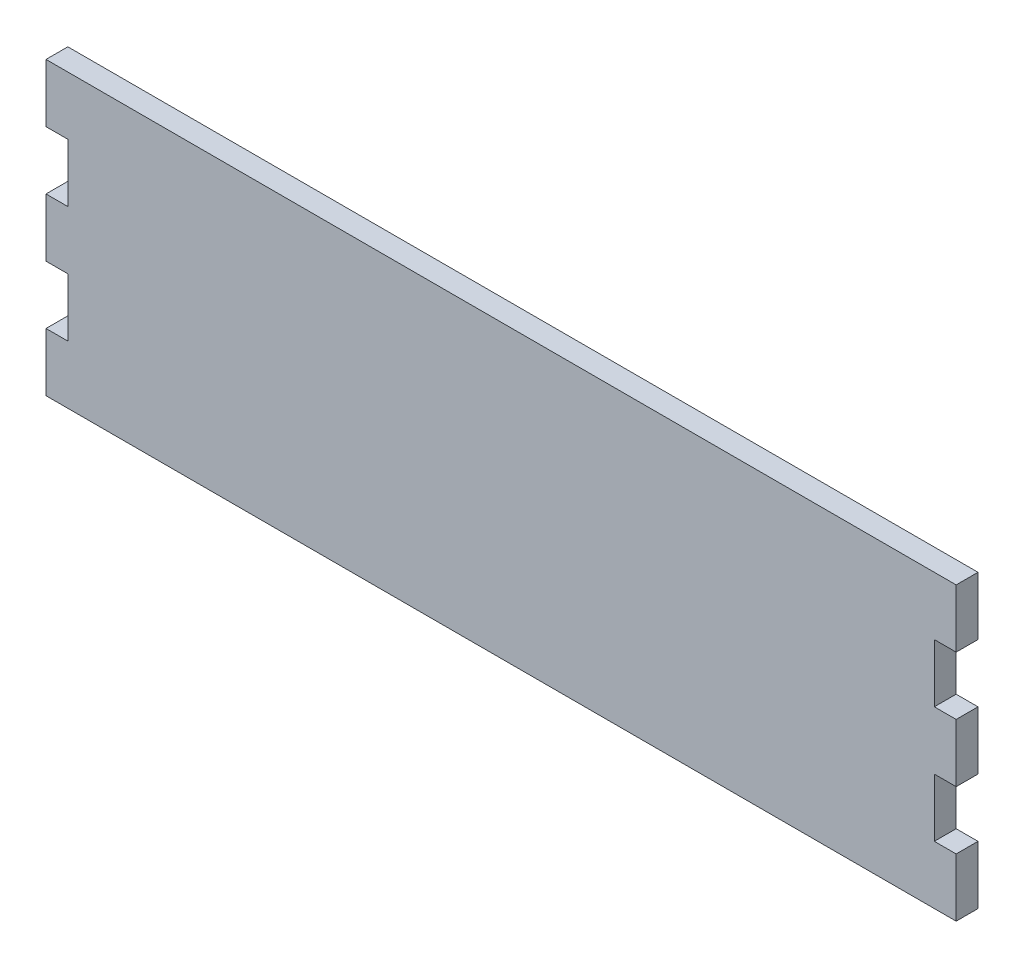
ISO-10303-21;
HEADER;
FILE_DESCRIPTION(('STEP AP214'),'2;1');
FILE_NAME('part.step','',(''),(''),'','','');
FILE_SCHEMA(('AUTOMOTIVE_DESIGN { 1 0 10303 214 1 1 1 1 }'));
ENDSEC;
DATA;
#1=APPLICATION_CONTEXT('core data for automotive mechanical design processes');
#2=APPLICATION_PROTOCOL_DEFINITION('international standard','automotive_design',2000,#1);
#3=PRODUCT_CONTEXT('',#1,'mechanical');
#4=PRODUCT('Part','Part','',(#3));
#5=PRODUCT_RELATED_PRODUCT_CATEGORY('part','',(#4));
#6=PRODUCT_DEFINITION_FORMATION('','',#4);
#7=PRODUCT_DEFINITION_CONTEXT('part definition',#1,'design');
#8=PRODUCT_DEFINITION('design','',#6,#7);
#9=PRODUCT_DEFINITION_SHAPE('','',#8);
#10=(LENGTH_UNIT() NAMED_UNIT(*) SI_UNIT(.MILLI.,.METRE.));
#11=(NAMED_UNIT(*) PLANE_ANGLE_UNIT() SI_UNIT($,.RADIAN.));
#12=(NAMED_UNIT(*) SI_UNIT($,.STERADIAN.) SOLID_ANGLE_UNIT());
#13=UNCERTAINTY_MEASURE_WITH_UNIT(LENGTH_MEASURE(1.E-05),#10,'distance_accuracy_value','');
#14=(GEOMETRIC_REPRESENTATION_CONTEXT(3) GLOBAL_UNCERTAINTY_ASSIGNED_CONTEXT((#13)) GLOBAL_UNIT_ASSIGNED_CONTEXT((#10,
#11,#12)) REPRESENTATION_CONTEXT('',''));
#15=CARTESIAN_POINT('',(0.,0.,0.));
#16=DIRECTION('',(0.,0.,1.));
#17=DIRECTION('',(1.,0.,0.));
#18=AXIS2_PLACEMENT_3D('',#15,#16,#17);
#19=CARTESIAN_POINT('',(-125.,-40.,6.));
#20=DIRECTION('',(1.,0.,0.));
#21=DIRECTION('',(0.,0.,-1.));
#22=AXIS2_PLACEMENT_3D('',#19,#20,#21);
#23=PLANE('',#22);
#24=DIRECTION('',(0.,-1.,0.));
#25=VECTOR('',#24,1.);
#26=CARTESIAN_POINT('',(-125.,-40.,0.));
#27=LINE('',#26,#25);
#28=CARTESIAN_POINT('',(-125.,7.99999999999999,0.));
#29=VERTEX_POINT('',#28);
#30=CARTESIAN_POINT('',(-125.,-8.00000000000002,0.));
#31=VERTEX_POINT('',#30);
#32=EDGE_CURVE('E199',#29,#31,#27,.T.);
#33=ORIENTED_EDGE('',*,*,#32,.T.);
#34=DIRECTION('',(0.,0.,1.));
#35=VECTOR('',#34,1.);
#36=CARTESIAN_POINT('',(-125.,-8.00000000000002,0.));
#37=LINE('',#36,#35);
#38=CARTESIAN_POINT('',(-125.,-8.00000000000002,6.));
#39=VERTEX_POINT('',#38);
#40=EDGE_CURVE('E303',#31,#39,#37,.T.);
#41=ORIENTED_EDGE('',*,*,#40,.T.);
#42=DIRECTION('',(0.,-1.,0.));
#43=VECTOR('',#42,1.);
#44=CARTESIAN_POINT('',(-125.,-40.,6.));
#45=LINE('',#44,#43);
#46=CARTESIAN_POINT('',(-125.,7.99999999999999,6.));
#47=VERTEX_POINT('',#46);
#48=EDGE_CURVE('E315',#47,#39,#45,.T.);
#49=ORIENTED_EDGE('',*,*,#48,.F.);
#50=DIRECTION('',(0.,0.,1.));
#51=VECTOR('',#50,1.);
#52=CARTESIAN_POINT('',(-125.,7.99999999999999,0.));
#53=LINE('',#52,#51);
#54=EDGE_CURVE('E298',#29,#47,#53,.T.);
#55=ORIENTED_EDGE('',*,*,#54,.F.);
#56=EDGE_LOOP('',(#33,#41,#49,#55));
#57=FACE_BOUND('',#56,.T.);
#58=ADVANCED_FACE('F38',(#57),#23,.F.);
#59=CARTESIAN_POINT('',(-125.,40.,0.));
#60=VERTEX_POINT('',#59);
#61=CARTESIAN_POINT('',(-125.,24.,0.));
#62=VERTEX_POINT('',#61);
#63=EDGE_CURVE('E202',#60,#62,#27,.T.);
#64=ORIENTED_EDGE('',*,*,#63,.T.);
#65=DIRECTION('',(0.,0.,1.));
#66=VECTOR('',#65,1.);
#67=CARTESIAN_POINT('',(-125.,24.,0.));
#68=LINE('',#67,#66);
#69=CARTESIAN_POINT('',(-125.,24.,6.));
#70=VERTEX_POINT('',#69);
#71=EDGE_CURVE('E200',#62,#70,#68,.T.);
#72=ORIENTED_EDGE('',*,*,#71,.T.);
#73=CARTESIAN_POINT('',(-125.,40.,6.));
#74=VERTEX_POINT('',#73);
#75=EDGE_CURVE('E311',#74,#70,#45,.T.);
#76=ORIENTED_EDGE('',*,*,#75,.F.);
#77=DIRECTION('',(0.,0.,-1.));
#78=VECTOR('',#77,1.);
#79=CARTESIAN_POINT('',(-125.,40.,6.));
#80=LINE('',#79,#78);
#81=EDGE_CURVE('E224',#74,#60,#80,.T.);
#82=ORIENTED_EDGE('',*,*,#81,.T.);
#83=EDGE_LOOP('',(#64,#72,#76,#82));
#84=FACE_BOUND('',#83,.T.);
#85=ADVANCED_FACE('F332',(#84),#23,.F.);
#86=CARTESIAN_POINT('',(125.,-40.,6.));
#87=DIRECTION('',(-1.,0.,0.));
#88=DIRECTION('',(0.,0.,1.));
#89=AXIS2_PLACEMENT_3D('',#86,#87,#88);
#90=PLANE('',#89);
#91=DIRECTION('',(0.,1.,0.));
#92=VECTOR('',#91,1.);
#93=CARTESIAN_POINT('',(125.,-40.,0.));
#94=LINE('',#93,#92);
#95=CARTESIAN_POINT('',(125.,-8.00000000000002,0.));
#96=VERTEX_POINT('',#95);
#97=CARTESIAN_POINT('',(125.,7.99999999999999,0.));
#98=VERTEX_POINT('',#97);
#99=EDGE_CURVE('E217',#96,#98,#94,.T.);
#100=ORIENTED_EDGE('',*,*,#99,.T.);
#101=DIRECTION('',(0.,0.,1.));
#102=VECTOR('',#101,1.);
#103=CARTESIAN_POINT('',(125.,7.99999999999999,0.));
#104=LINE('',#103,#102);
#105=CARTESIAN_POINT('',(125.,7.99999999999999,6.));
#106=VERTEX_POINT('',#105);
#107=EDGE_CURVE('E254',#98,#106,#104,.T.);
#108=ORIENTED_EDGE('',*,*,#107,.T.);
#109=DIRECTION('',(0.,1.,0.));
#110=VECTOR('',#109,1.);
#111=CARTESIAN_POINT('',(125.,-40.,6.));
#112=LINE('',#111,#110);
#113=CARTESIAN_POINT('',(125.,-8.00000000000002,6.));
#114=VERTEX_POINT('',#113);
#115=EDGE_CURVE('E318',#114,#106,#112,.T.);
#116=ORIENTED_EDGE('',*,*,#115,.F.);
#117=DIRECTION('',(0.,0.,1.));
#118=VECTOR('',#117,1.);
#119=CARTESIAN_POINT('',(125.,-8.00000000000002,0.));
#120=LINE('',#119,#118);
#121=EDGE_CURVE('E262',#96,#114,#120,.T.);
#122=ORIENTED_EDGE('',*,*,#121,.F.);
#123=EDGE_LOOP('',(#100,#108,#116,#122));
#124=FACE_BOUND('',#123,.T.);
#125=ADVANCED_FACE('F360',(#124),#90,.F.);
#126=CARTESIAN_POINT('',(125.,-40.,0.));
#127=VERTEX_POINT('',#126);
#128=CARTESIAN_POINT('',(125.,-24.,0.));
#129=VERTEX_POINT('',#128);
#130=EDGE_CURVE('E219',#127,#129,#94,.T.);
#131=ORIENTED_EDGE('',*,*,#130,.T.);
#132=DIRECTION('',(0.,0.,1.));
#133=VECTOR('',#132,1.);
#134=CARTESIAN_POINT('',(125.,-24.,0.));
#135=LINE('',#134,#133);
#136=CARTESIAN_POINT('',(125.,-24.,6.));
#137=VERTEX_POINT('',#136);
#138=EDGE_CURVE('E251',#129,#137,#135,.T.);
#139=ORIENTED_EDGE('',*,*,#138,.T.);
#140=CARTESIAN_POINT('',(125.,-40.,6.));
#141=VERTEX_POINT('',#140);
#142=EDGE_CURVE('E234',#141,#137,#112,.T.);
#143=ORIENTED_EDGE('',*,*,#142,.F.);
#144=DIRECTION('',(0.,0.,-1.));
#145=VECTOR('',#144,1.);
#146=CARTESIAN_POINT('',(125.,-40.,6.));
#147=LINE('',#146,#145);
#148=EDGE_CURVE('E46',#141,#127,#147,.T.);
#149=ORIENTED_EDGE('',*,*,#148,.T.);
#150=EDGE_LOOP('',(#131,#139,#143,#149));
#151=FACE_BOUND('',#150,.T.);
#152=ADVANCED_FACE('F231',(#151),#90,.F.);
#153=CARTESIAN_POINT('',(-125.,-24.,6.));
#154=VERTEX_POINT('',#153);
#155=CARTESIAN_POINT('',(-125.,-40.,6.));
#156=VERTEX_POINT('',#155);
#157=EDGE_CURVE('E193',#154,#156,#45,.T.);
#158=ORIENTED_EDGE('',*,*,#157,.F.);
#159=DIRECTION('',(0.,0.,1.));
#160=VECTOR('',#159,1.);
#161=CARTESIAN_POINT('',(-125.,-24.,0.));
#162=LINE('',#161,#160);
#163=CARTESIAN_POINT('',(-125.,-24.,0.));
#164=VERTEX_POINT('',#163);
#165=EDGE_CURVE('E179',#164,#154,#162,.T.);
#166=ORIENTED_EDGE('',*,*,#165,.F.);
#167=CARTESIAN_POINT('',(-125.,-40.,0.));
#168=VERTEX_POINT('',#167);
#169=EDGE_CURVE('E191',#164,#168,#27,.T.);
#170=ORIENTED_EDGE('',*,*,#169,.T.);
#171=DIRECTION('',(0.,0.,-1.));
#172=VECTOR('',#171,1.);
#173=CARTESIAN_POINT('',(-125.,-40.,6.));
#174=LINE('',#173,#172);
#175=EDGE_CURVE('E11',#156,#168,#174,.T.);
#176=ORIENTED_EDGE('',*,*,#175,.F.);
#177=EDGE_LOOP('',(#158,#166,#170,#176));
#178=FACE_BOUND('',#177,.T.);
#179=ADVANCED_FACE('F40',(#178),#23,.F.);
#180=CARTESIAN_POINT('',(125.,-40.,6.));
#181=DIRECTION('',(0.,1.,0.));
#182=DIRECTION('',(-1.,0.,0.));
#183=AXIS2_PLACEMENT_3D('',#180,#181,#182);
#184=PLANE('',#183);
#185=DIRECTION('',(1.,0.,0.));
#186=VECTOR('',#185,1.);
#187=CARTESIAN_POINT('',(125.,-40.,0.));
#188=LINE('',#187,#186);
#189=EDGE_CURVE('E198',#168,#127,#188,.T.);
#190=ORIENTED_EDGE('',*,*,#189,.T.);
#191=ORIENTED_EDGE('',*,*,#148,.F.);
#192=DIRECTION('',(1.,0.,0.));
#193=VECTOR('',#192,1.);
#194=CARTESIAN_POINT('',(125.,-40.,6.));
#195=LINE('',#194,#193);
#196=EDGE_CURVE('E314',#156,#141,#195,.T.);
#197=ORIENTED_EDGE('',*,*,#196,.F.);
#198=ORIENTED_EDGE('',*,*,#175,.T.);
#199=EDGE_LOOP('',(#190,#191,#197,#198));
#200=FACE_BOUND('',#199,.T.);
#201=ADVANCED_FACE('F351',(#200),#184,.F.);
#202=CARTESIAN_POINT('',(125.,24.,6.));
#203=VERTEX_POINT('',#202);
#204=CARTESIAN_POINT('',(125.,40.,6.));
#205=VERTEX_POINT('',#204);
#206=EDGE_CURVE('E317',#203,#205,#112,.T.);
#207=ORIENTED_EDGE('',*,*,#206,.F.);
#208=DIRECTION('',(0.,0.,1.));
#209=VECTOR('',#208,1.);
#210=CARTESIAN_POINT('',(125.,24.,0.));
#211=LINE('',#210,#209);
#212=CARTESIAN_POINT('',(125.,24.,0.));
#213=VERTEX_POINT('',#212);
#214=EDGE_CURVE('E273',#213,#203,#211,.T.);
#215=ORIENTED_EDGE('',*,*,#214,.F.);
#216=CARTESIAN_POINT('',(125.,40.,0.));
#217=VERTEX_POINT('',#216);
#218=EDGE_CURVE('E213',#213,#217,#94,.T.);
#219=ORIENTED_EDGE('',*,*,#218,.T.);
#220=DIRECTION('',(0.,0.,-1.));
#221=VECTOR('',#220,1.);
#222=CARTESIAN_POINT('',(125.,40.,6.));
#223=LINE('',#222,#221);
#224=EDGE_CURVE('E226',#205,#217,#223,.T.);
#225=ORIENTED_EDGE('',*,*,#224,.F.);
#226=EDGE_LOOP('',(#207,#215,#219,#225));
#227=FACE_BOUND('',#226,.T.);
#228=ADVANCED_FACE('F353',(#227),#90,.F.);
#229=CARTESIAN_POINT('',(125.,40.,6.));
#230=DIRECTION('',(0.,-1.,0.));
#231=DIRECTION('',(1.,0.,0.));
#232=AXIS2_PLACEMENT_3D('',#229,#230,#231);
#233=PLANE('',#232);
#234=DIRECTION('',(-1.,0.,0.));
#235=VECTOR('',#234,1.);
#236=CARTESIAN_POINT('',(125.,40.,0.));
#237=LINE('',#236,#235);
#238=EDGE_CURVE('E222',#217,#60,#237,.T.);
#239=ORIENTED_EDGE('',*,*,#238,.T.);
#240=ORIENTED_EDGE('',*,*,#81,.F.);
#241=DIRECTION('',(-1.,0.,0.));
#242=VECTOR('',#241,1.);
#243=CARTESIAN_POINT('',(125.,40.,6.));
#244=LINE('',#243,#242);
#245=EDGE_CURVE('E227',#205,#74,#244,.T.);
#246=ORIENTED_EDGE('',*,*,#245,.F.);
#247=ORIENTED_EDGE('',*,*,#224,.T.);
#248=EDGE_LOOP('',(#239,#240,#246,#247));
#249=FACE_BOUND('',#248,.T.);
#250=ADVANCED_FACE('F330',(#249),#233,.F.);
#251=CARTESIAN_POINT('',(0.,0.,6.));
#252=DIRECTION('',(0.,0.,1.));
#253=DIRECTION('',(1.,0.,0.));
#254=AXIS2_PLACEMENT_3D('',#251,#252,#253);
#255=PLANE('',#254);
#256=DIRECTION('',(1.,0.,0.));
#257=VECTOR('',#256,1.);
#258=CARTESIAN_POINT('',(125.,7.99999999999999,6.));
#259=LINE('',#258,#257);
#260=CARTESIAN_POINT('',(119.,7.99999999999999,6.));
#261=VERTEX_POINT('',#260);
#262=EDGE_CURVE('E268',#261,#106,#259,.T.);
#263=ORIENTED_EDGE('',*,*,#262,.F.);
#264=DIRECTION('',(0.,-1.,0.));
#265=VECTOR('',#264,1.);
#266=CARTESIAN_POINT('',(119.,24.,6.));
#267=LINE('',#266,#265);
#268=CARTESIAN_POINT('',(119.,24.,6.));
#269=VERTEX_POINT('',#268);
#270=EDGE_CURVE('E277',#269,#261,#267,.T.);
#271=ORIENTED_EDGE('',*,*,#270,.F.);
#272=DIRECTION('',(-1.,0.,0.));
#273=VECTOR('',#272,1.);
#274=CARTESIAN_POINT('',(125.,24.,6.));
#275=LINE('',#274,#273);
#276=EDGE_CURVE('E274',#203,#269,#275,.T.);
#277=ORIENTED_EDGE('',*,*,#276,.F.);
#278=ORIENTED_EDGE('',*,*,#206,.T.);
#279=ORIENTED_EDGE('',*,*,#245,.T.);
#280=ORIENTED_EDGE('',*,*,#75,.T.);
#281=DIRECTION('',(-1.,0.,0.));
#282=VECTOR('',#281,1.);
#283=CARTESIAN_POINT('',(-125.,24.,6.));
#284=LINE('',#283,#282);
#285=CARTESIAN_POINT('',(-119.,24.,6.));
#286=VERTEX_POINT('',#285);
#287=EDGE_CURVE('E292',#286,#70,#284,.T.);
#288=ORIENTED_EDGE('',*,*,#287,.F.);
#289=DIRECTION('',(0.,1.,0.));
#290=VECTOR('',#289,1.);
#291=CARTESIAN_POINT('',(-119.,24.,6.));
#292=LINE('',#291,#290);
#293=CARTESIAN_POINT('',(-119.,7.99999999999999,6.));
#294=VERTEX_POINT('',#293);
#295=EDGE_CURVE('E302',#294,#286,#292,.T.);
#296=ORIENTED_EDGE('',*,*,#295,.F.);
#297=DIRECTION('',(1.,0.,0.));
#298=VECTOR('',#297,1.);
#299=CARTESIAN_POINT('',(-125.,7.99999999999999,6.));
#300=LINE('',#299,#298);
#301=EDGE_CURVE('E299',#47,#294,#300,.T.);
#302=ORIENTED_EDGE('',*,*,#301,.F.);
#303=ORIENTED_EDGE('',*,*,#48,.T.);
#304=DIRECTION('',(-1.,0.,0.));
#305=VECTOR('',#304,1.);
#306=CARTESIAN_POINT('',(-125.,-8.00000000000002,6.));
#307=LINE('',#306,#305);
#308=CARTESIAN_POINT('',(-119.,-8.00000000000002,6.));
#309=VERTEX_POINT('',#308);
#310=EDGE_CURVE('E186',#309,#39,#307,.T.);
#311=ORIENTED_EDGE('',*,*,#310,.F.);
#312=DIRECTION('',(0.,1.,0.));
#313=VECTOR('',#312,1.);
#314=CARTESIAN_POINT('',(-119.,-24.,6.));
#315=LINE('',#314,#313);
#316=CARTESIAN_POINT('',(-119.,-24.,6.));
#317=VERTEX_POINT('',#316);
#318=EDGE_CURVE('E422',#317,#309,#315,.T.);
#319=ORIENTED_EDGE('',*,*,#318,.F.);
#320=DIRECTION('',(1.,0.,0.));
#321=VECTOR('',#320,1.);
#322=CARTESIAN_POINT('',(-125.,-24.,6.));
#323=LINE('',#322,#321);
#324=EDGE_CURVE('E259',#154,#317,#323,.T.);
#325=ORIENTED_EDGE('',*,*,#324,.F.);
#326=ORIENTED_EDGE('',*,*,#157,.T.);
#327=ORIENTED_EDGE('',*,*,#196,.T.);
#328=ORIENTED_EDGE('',*,*,#142,.T.);
#329=DIRECTION('',(1.,0.,0.));
#330=VECTOR('',#329,1.);
#331=CARTESIAN_POINT('',(125.,-24.,6.));
#332=LINE('',#331,#330);
#333=CARTESIAN_POINT('',(119.,-24.,6.));
#334=VERTEX_POINT('',#333);
#335=EDGE_CURVE('E252',#334,#137,#332,.T.);
#336=ORIENTED_EDGE('',*,*,#335,.F.);
#337=DIRECTION('',(0.,-1.,0.));
#338=VECTOR('',#337,1.);
#339=CARTESIAN_POINT('',(119.,-24.,6.));
#340=LINE('',#339,#338);
#341=CARTESIAN_POINT('',(119.,-8.00000000000002,6.));
#342=VERTEX_POINT('',#341);
#343=EDGE_CURVE('E242',#342,#334,#340,.T.);
#344=ORIENTED_EDGE('',*,*,#343,.F.);
#345=DIRECTION('',(-1.,0.,0.));
#346=VECTOR('',#345,1.);
#347=CARTESIAN_POINT('',(125.,-8.00000000000002,6.));
#348=LINE('',#347,#346);
#349=EDGE_CURVE('E246',#114,#342,#348,.T.);
#350=ORIENTED_EDGE('',*,*,#349,.F.);
#351=ORIENTED_EDGE('',*,*,#115,.T.);
#352=EDGE_LOOP('',(#263,#271,#277,#278,#279,#280,#288,#296,#302,#303,#311,#319,#325,#326,#327,
#328,#336,#344,#350,#351));
#353=FACE_BOUND('',#352,.T.);
#354=ADVANCED_FACE('F323',(#353),#255,.T.);
#355=CARTESIAN_POINT('',(0.,0.,0.));
#356=DIRECTION('',(0.,0.,1.));
#357=DIRECTION('',(1.,0.,0.));
#358=AXIS2_PLACEMENT_3D('',#355,#356,#357);
#359=PLANE('',#358);
#360=DIRECTION('',(0.,-1.,0.));
#361=VECTOR('',#360,1.);
#362=CARTESIAN_POINT('',(119.,24.,0.));
#363=LINE('',#362,#361);
#364=CARTESIAN_POINT('',(119.,24.,0.));
#365=VERTEX_POINT('',#364);
#366=CARTESIAN_POINT('',(119.,7.99999999999999,0.));
#367=VERTEX_POINT('',#366);
#368=EDGE_CURVE('E53',#365,#367,#363,.T.);
#369=ORIENTED_EDGE('',*,*,#368,.T.);
#370=DIRECTION('',(1.,0.,0.));
#371=VECTOR('',#370,1.);
#372=CARTESIAN_POINT('',(125.,7.99999999999999,0.));
#373=LINE('',#372,#371);
#374=EDGE_CURVE('E270',#367,#98,#373,.T.);
#375=ORIENTED_EDGE('',*,*,#374,.T.);
#376=ORIENTED_EDGE('',*,*,#99,.F.);
#377=DIRECTION('',(-1.,0.,0.));
#378=VECTOR('',#377,1.);
#379=CARTESIAN_POINT('',(125.,-8.00000000000002,0.));
#380=LINE('',#379,#378);
#381=CARTESIAN_POINT('',(119.,-8.00000000000002,0.));
#382=VERTEX_POINT('',#381);
#383=EDGE_CURVE('E241',#96,#382,#380,.T.);
#384=ORIENTED_EDGE('',*,*,#383,.T.);
#385=DIRECTION('',(0.,-1.,0.));
#386=VECTOR('',#385,1.);
#387=CARTESIAN_POINT('',(119.,-24.,0.));
#388=LINE('',#387,#386);
#389=CARTESIAN_POINT('',(119.,-24.,0.));
#390=VERTEX_POINT('',#389);
#391=EDGE_CURVE('E61',#382,#390,#388,.T.);
#392=ORIENTED_EDGE('',*,*,#391,.T.);
#393=DIRECTION('',(1.,0.,0.));
#394=VECTOR('',#393,1.);
#395=CARTESIAN_POINT('',(125.,-24.,0.));
#396=LINE('',#395,#394);
#397=EDGE_CURVE('E238',#390,#129,#396,.T.);
#398=ORIENTED_EDGE('',*,*,#397,.T.);
#399=ORIENTED_EDGE('',*,*,#130,.F.);
#400=ORIENTED_EDGE('',*,*,#189,.F.);
#401=ORIENTED_EDGE('',*,*,#169,.F.);
#402=DIRECTION('',(1.,0.,0.));
#403=VECTOR('',#402,1.);
#404=CARTESIAN_POINT('',(-125.,-24.,0.));
#405=LINE('',#404,#403);
#406=CARTESIAN_POINT('',(-119.,-24.,0.));
#407=VERTEX_POINT('',#406);
#408=EDGE_CURVE('E175',#164,#407,#405,.T.);
#409=ORIENTED_EDGE('',*,*,#408,.T.);
#410=DIRECTION('',(0.,1.,0.));
#411=VECTOR('',#410,1.);
#412=CARTESIAN_POINT('',(-119.,-24.,0.));
#413=LINE('',#412,#411);
#414=CARTESIAN_POINT('',(-119.,-8.00000000000002,0.));
#415=VERTEX_POINT('',#414);
#416=EDGE_CURVE('E185',#407,#415,#413,.T.);
#417=ORIENTED_EDGE('',*,*,#416,.T.);
#418=DIRECTION('',(-1.,0.,0.));
#419=VECTOR('',#418,1.);
#420=CARTESIAN_POINT('',(-125.,-8.00000000000002,0.));
#421=LINE('',#420,#419);
#422=EDGE_CURVE('E194',#415,#31,#421,.T.);
#423=ORIENTED_EDGE('',*,*,#422,.T.);
#424=ORIENTED_EDGE('',*,*,#32,.F.);
#425=DIRECTION('',(1.,0.,0.));
#426=VECTOR('',#425,1.);
#427=CARTESIAN_POINT('',(-125.,7.99999999999999,0.));
#428=LINE('',#427,#426);
#429=CARTESIAN_POINT('',(-119.,7.99999999999999,0.));
#430=VERTEX_POINT('',#429);
#431=EDGE_CURVE('E288',#29,#430,#428,.T.);
#432=ORIENTED_EDGE('',*,*,#431,.T.);
#433=DIRECTION('',(0.,1.,0.));
#434=VECTOR('',#433,1.);
#435=CARTESIAN_POINT('',(-119.,24.,0.));
#436=LINE('',#435,#434);
#437=CARTESIAN_POINT('',(-119.,24.,0.));
#438=VERTEX_POINT('',#437);
#439=EDGE_CURVE('E291',#430,#438,#436,.T.);
#440=ORIENTED_EDGE('',*,*,#439,.T.);
#441=DIRECTION('',(-1.,0.,0.));
#442=VECTOR('',#441,1.);
#443=CARTESIAN_POINT('',(-125.,24.,0.));
#444=LINE('',#443,#442);
#445=EDGE_CURVE('E295',#438,#62,#444,.T.);
#446=ORIENTED_EDGE('',*,*,#445,.T.);
#447=ORIENTED_EDGE('',*,*,#63,.F.);
#448=ORIENTED_EDGE('',*,*,#238,.F.);
#449=ORIENTED_EDGE('',*,*,#218,.F.);
#450=DIRECTION('',(-1.,0.,0.));
#451=VECTOR('',#450,1.);
#452=CARTESIAN_POINT('',(125.,24.,0.));
#453=LINE('',#452,#451);
#454=EDGE_CURVE('E265',#213,#365,#453,.T.);
#455=ORIENTED_EDGE('',*,*,#454,.T.);
#456=EDGE_LOOP('',(#369,#375,#376,#384,#392,#398,#399,#400,#401,#409,#417,#423,#424,#432,#440,
#446,#447,#448,#449,#455));
#457=FACE_BOUND('',#456,.T.);
#458=ADVANCED_FACE('F196',(#457),#359,.F.);
#459=CARTESIAN_POINT('',(-125.,24.,0.));
#460=DIRECTION('',(0.,1.,0.));
#461=DIRECTION('',(0.,0.,1.));
#462=AXIS2_PLACEMENT_3D('',#459,#460,#461);
#463=PLANE('',#462);
#464=ORIENTED_EDGE('',*,*,#287,.T.);
#465=ORIENTED_EDGE('',*,*,#71,.F.);
#466=ORIENTED_EDGE('',*,*,#445,.F.);
#467=DIRECTION('',(0.,0.,1.));
#468=VECTOR('',#467,1.);
#469=CARTESIAN_POINT('',(-119.,24.,0.));
#470=LINE('',#469,#468);
#471=EDGE_CURVE('E205',#438,#286,#470,.T.);
#472=ORIENTED_EDGE('',*,*,#471,.T.);
#473=EDGE_LOOP('',(#464,#465,#466,#472));
#474=FACE_BOUND('',#473,.T.);
#475=ADVANCED_FACE('F335',(#474),#463,.F.);
#476=CARTESIAN_POINT('',(-119.,24.,0.));
#477=DIRECTION('',(1.,0.,0.));
#478=DIRECTION('',(0.,0.,-1.));
#479=AXIS2_PLACEMENT_3D('',#476,#477,#478);
#480=PLANE('',#479);
#481=ORIENTED_EDGE('',*,*,#295,.T.);
#482=ORIENTED_EDGE('',*,*,#471,.F.);
#483=ORIENTED_EDGE('',*,*,#439,.F.);
#484=DIRECTION('',(0.,0.,1.));
#485=VECTOR('',#484,1.);
#486=CARTESIAN_POINT('',(-119.,7.99999999999999,0.));
#487=LINE('',#486,#485);
#488=EDGE_CURVE('E308',#430,#294,#487,.T.);
#489=ORIENTED_EDGE('',*,*,#488,.T.);
#490=EDGE_LOOP('',(#481,#482,#483,#489));
#491=FACE_BOUND('',#490,.T.);
#492=ADVANCED_FACE('F339',(#491),#480,.F.);
#493=CARTESIAN_POINT('',(-125.,7.99999999999999,0.));
#494=DIRECTION('',(0.,-1.,0.));
#495=DIRECTION('',(0.,0.,-1.));
#496=AXIS2_PLACEMENT_3D('',#493,#494,#495);
#497=PLANE('',#496);
#498=ORIENTED_EDGE('',*,*,#301,.T.);
#499=ORIENTED_EDGE('',*,*,#488,.F.);
#500=ORIENTED_EDGE('',*,*,#431,.F.);
#501=ORIENTED_EDGE('',*,*,#54,.T.);
#502=EDGE_LOOP('',(#498,#499,#500,#501));
#503=FACE_BOUND('',#502,.T.);
#504=ADVANCED_FACE('F341',(#503),#497,.F.);
#505=CARTESIAN_POINT('',(-125.,-8.00000000000002,0.));
#506=DIRECTION('',(0.,1.,0.));
#507=DIRECTION('',(-1.,0.,0.));
#508=AXIS2_PLACEMENT_3D('',#505,#506,#507);
#509=PLANE('',#508);
#510=ORIENTED_EDGE('',*,*,#310,.T.);
#511=ORIENTED_EDGE('',*,*,#40,.F.);
#512=ORIENTED_EDGE('',*,*,#422,.F.);
#513=DIRECTION('',(0.,0.,1.));
#514=VECTOR('',#513,1.);
#515=CARTESIAN_POINT('',(-119.,-8.00000000000002,0.));
#516=LINE('',#515,#514);
#517=EDGE_CURVE('E420',#415,#309,#516,.T.);
#518=ORIENTED_EDGE('',*,*,#517,.T.);
#519=EDGE_LOOP('',(#510,#511,#512,#518));
#520=FACE_BOUND('',#519,.T.);
#521=ADVANCED_FACE('F382',(#520),#509,.F.);
#522=CARTESIAN_POINT('',(-119.,-24.,0.));
#523=DIRECTION('',(1.,0.,0.));
#524=DIRECTION('',(0.,0.,-1.));
#525=AXIS2_PLACEMENT_3D('',#522,#523,#524);
#526=PLANE('',#525);
#527=ORIENTED_EDGE('',*,*,#318,.T.);
#528=ORIENTED_EDGE('',*,*,#517,.F.);
#529=ORIENTED_EDGE('',*,*,#416,.F.);
#530=DIRECTION('',(0.,0.,1.));
#531=VECTOR('',#530,1.);
#532=CARTESIAN_POINT('',(-119.,-24.,0.));
#533=LINE('',#532,#531);
#534=EDGE_CURVE('E181',#407,#317,#533,.T.);
#535=ORIENTED_EDGE('',*,*,#534,.T.);
#536=EDGE_LOOP('',(#527,#528,#529,#535));
#537=FACE_BOUND('',#536,.T.);
#538=ADVANCED_FACE('F410',(#537),#526,.F.);
#539=CARTESIAN_POINT('',(-125.,-24.,0.));
#540=DIRECTION('',(0.,-1.,0.));
#541=DIRECTION('',(0.,0.,-1.));
#542=AXIS2_PLACEMENT_3D('',#539,#540,#541);
#543=PLANE('',#542);
#544=ORIENTED_EDGE('',*,*,#324,.T.);
#545=ORIENTED_EDGE('',*,*,#534,.F.);
#546=ORIENTED_EDGE('',*,*,#408,.F.);
#547=ORIENTED_EDGE('',*,*,#165,.T.);
#548=EDGE_LOOP('',(#544,#545,#546,#547));
#549=FACE_BOUND('',#548,.T.);
#550=ADVANCED_FACE('F178',(#549),#543,.F.);
#551=CARTESIAN_POINT('',(125.,-24.,0.));
#552=DIRECTION('',(0.,-1.,0.));
#553=DIRECTION('',(0.,0.,-1.));
#554=AXIS2_PLACEMENT_3D('',#551,#552,#553);
#555=PLANE('',#554);
#556=ORIENTED_EDGE('',*,*,#335,.T.);
#557=ORIENTED_EDGE('',*,*,#138,.F.);
#558=ORIENTED_EDGE('',*,*,#397,.F.);
#559=DIRECTION('',(0.,0.,1.));
#560=VECTOR('',#559,1.);
#561=CARTESIAN_POINT('',(119.,-24.,0.));
#562=LINE('',#561,#560);
#563=EDGE_CURVE('E257',#390,#334,#562,.T.);
#564=ORIENTED_EDGE('',*,*,#563,.T.);
#565=EDGE_LOOP('',(#556,#557,#558,#564));
#566=FACE_BOUND('',#565,.T.);
#567=ADVANCED_FACE('F399',(#566),#555,.F.);
#568=CARTESIAN_POINT('',(119.,-24.,0.));
#569=DIRECTION('',(-1.,0.,0.));
#570=DIRECTION('',(0.,0.,1.));
#571=AXIS2_PLACEMENT_3D('',#568,#569,#570);
#572=PLANE('',#571);
#573=ORIENTED_EDGE('',*,*,#343,.T.);
#574=ORIENTED_EDGE('',*,*,#563,.F.);
#575=ORIENTED_EDGE('',*,*,#391,.F.);
#576=DIRECTION('',(0.,0.,1.));
#577=VECTOR('',#576,1.);
#578=CARTESIAN_POINT('',(119.,-8.00000000000002,0.));
#579=LINE('',#578,#577);
#580=EDGE_CURVE('E260',#382,#342,#579,.T.);
#581=ORIENTED_EDGE('',*,*,#580,.T.);
#582=EDGE_LOOP('',(#573,#574,#575,#581));
#583=FACE_BOUND('',#582,.T.);
#584=ADVANCED_FACE('F402',(#583),#572,.F.);
#585=CARTESIAN_POINT('',(125.,-8.00000000000002,0.));
#586=DIRECTION('',(0.,1.,0.));
#587=DIRECTION('',(-1.,0.,0.));
#588=AXIS2_PLACEMENT_3D('',#585,#586,#587);
#589=PLANE('',#588);
#590=ORIENTED_EDGE('',*,*,#349,.T.);
#591=ORIENTED_EDGE('',*,*,#580,.F.);
#592=ORIENTED_EDGE('',*,*,#383,.F.);
#593=ORIENTED_EDGE('',*,*,#121,.T.);
#594=EDGE_LOOP('',(#590,#591,#592,#593));
#595=FACE_BOUND('',#594,.T.);
#596=ADVANCED_FACE('F397',(#595),#589,.F.);
#597=CARTESIAN_POINT('',(125.,7.99999999999999,0.));
#598=DIRECTION('',(0.,-1.,0.));
#599=DIRECTION('',(0.,0.,-1.));
#600=AXIS2_PLACEMENT_3D('',#597,#598,#599);
#601=PLANE('',#600);
#602=ORIENTED_EDGE('',*,*,#262,.T.);
#603=ORIENTED_EDGE('',*,*,#107,.F.);
#604=ORIENTED_EDGE('',*,*,#374,.F.);
#605=DIRECTION('',(0.,0.,1.));
#606=VECTOR('',#605,1.);
#607=CARTESIAN_POINT('',(119.,7.99999999999999,0.));
#608=LINE('',#607,#606);
#609=EDGE_CURVE('E283',#367,#261,#608,.T.);
#610=ORIENTED_EDGE('',*,*,#609,.T.);
#611=EDGE_LOOP('',(#602,#603,#604,#610));
#612=FACE_BOUND('',#611,.T.);
#613=ADVANCED_FACE('F394',(#612),#601,.F.);
#614=CARTESIAN_POINT('',(119.,24.,0.));
#615=DIRECTION('',(-1.,0.,0.));
#616=DIRECTION('',(0.,0.,1.));
#617=AXIS2_PLACEMENT_3D('',#614,#615,#616);
#618=PLANE('',#617);
#619=ORIENTED_EDGE('',*,*,#270,.T.);
#620=ORIENTED_EDGE('',*,*,#609,.F.);
#621=ORIENTED_EDGE('',*,*,#368,.F.);
#622=DIRECTION('',(0.,0.,1.));
#623=VECTOR('',#622,1.);
#624=CARTESIAN_POINT('',(119.,24.,0.));
#625=LINE('',#624,#623);
#626=EDGE_CURVE('E285',#365,#269,#625,.T.);
#627=ORIENTED_EDGE('',*,*,#626,.T.);
#628=EDGE_LOOP('',(#619,#620,#621,#627));
#629=FACE_BOUND('',#628,.T.);
#630=ADVANCED_FACE('F390',(#629),#618,.F.);
#631=CARTESIAN_POINT('',(125.,24.,0.));
#632=DIRECTION('',(0.,1.,0.));
#633=DIRECTION('',(0.,0.,1.));
#634=AXIS2_PLACEMENT_3D('',#631,#632,#633);
#635=PLANE('',#634);
#636=ORIENTED_EDGE('',*,*,#276,.T.);
#637=ORIENTED_EDGE('',*,*,#626,.F.);
#638=ORIENTED_EDGE('',*,*,#454,.F.);
#639=ORIENTED_EDGE('',*,*,#214,.T.);
#640=EDGE_LOOP('',(#636,#637,#638,#639));
#641=FACE_BOUND('',#640,.T.);
#642=ADVANCED_FACE('F387',(#641),#635,.F.);
#643=CLOSED_SHELL('',(#58,#85,#125,#152,#179,#201,#228,#250,#354,#458,#475,#492,#504,#521,#538,
#550,#567,#584,#596,#613,#630,#642));
#644=MANIFOLD_SOLID_BREP('B2',#643);
#645=ADVANCED_BREP_SHAPE_REPRESENTATION('',(#18,#644),#14);
#646=SHAPE_DEFINITION_REPRESENTATION(#9,#645);
ENDSEC;
END-ISO-10303-21;
